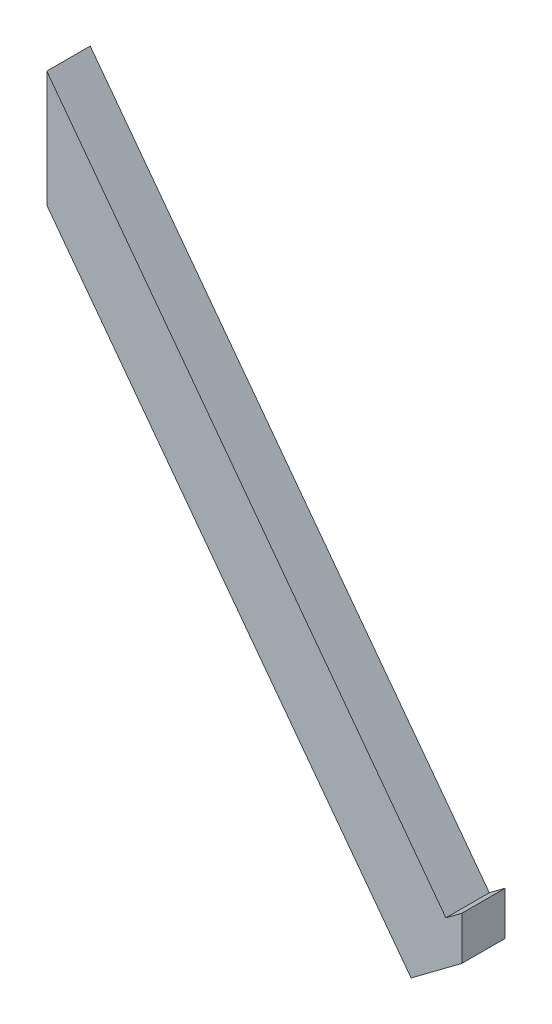
ISO-10303-21;
HEADER;
FILE_DESCRIPTION(('STEP AP214'),'2;1');
FILE_NAME('part.step','',(''),(''),'','','');
FILE_SCHEMA(('AUTOMOTIVE_DESIGN { 1 0 10303 214 1 1 1 1 }'));
ENDSEC;
DATA;
#1=APPLICATION_CONTEXT('core data for automotive mechanical design processes');
#2=APPLICATION_PROTOCOL_DEFINITION('international standard','automotive_design',2000,#1);
#3=PRODUCT_CONTEXT('',#1,'mechanical');
#4=PRODUCT('Part','Part','',(#3));
#5=PRODUCT_RELATED_PRODUCT_CATEGORY('part','',(#4));
#6=PRODUCT_DEFINITION_FORMATION('','',#4);
#7=PRODUCT_DEFINITION_CONTEXT('part definition',#1,'design');
#8=PRODUCT_DEFINITION('design','',#6,#7);
#9=PRODUCT_DEFINITION_SHAPE('','',#8);
#10=(LENGTH_UNIT() NAMED_UNIT(*) SI_UNIT(.MILLI.,.METRE.));
#11=(NAMED_UNIT(*) PLANE_ANGLE_UNIT() SI_UNIT($,.RADIAN.));
#12=(NAMED_UNIT(*) SI_UNIT($,.STERADIAN.) SOLID_ANGLE_UNIT());
#13=UNCERTAINTY_MEASURE_WITH_UNIT(LENGTH_MEASURE(1.E-05),#10,'distance_accuracy_value','');
#14=(GEOMETRIC_REPRESENTATION_CONTEXT(3) GLOBAL_UNCERTAINTY_ASSIGNED_CONTEXT((#13)) GLOBAL_UNIT_ASSIGNED_CONTEXT((#10,
#11,#12)) REPRESENTATION_CONTEXT('',''));
#15=CARTESIAN_POINT('',(0.,0.,0.));
#16=DIRECTION('',(0.,0.,1.));
#17=DIRECTION('',(1.,0.,0.));
#18=AXIS2_PLACEMENT_3D('',#15,#16,#17);
#19=CARTESIAN_POINT('',(-48.4510576676489,25.0386405763315,5.));
#20=DIRECTION('',(1.,0.,0.));
#21=DIRECTION('',(0.,0.,-1.));
#22=AXIS2_PLACEMENT_3D('',#19,#20,#21);
#23=PLANE('',#22);
#24=DIRECTION('',(0.,-1.,0.));
#25=VECTOR('',#24,1.);
#26=CARTESIAN_POINT('',(-48.4510576676489,25.0386405763315,0.));
#27=LINE('',#26,#25);
#28=CARTESIAN_POINT('',(-48.4510576676489,38.3967930670941,0.));
#29=VERTEX_POINT('',#28);
#30=CARTESIAN_POINT('',(-48.4510576676489,25.0386405763315,0.));
#31=VERTEX_POINT('',#30);
#32=EDGE_CURVE('E118',#29,#31,#27,.T.);
#33=ORIENTED_EDGE('',*,*,#32,.T.);
#34=DIRECTION('',(0.,0.,-1.));
#35=VECTOR('',#34,1.);
#36=CARTESIAN_POINT('',(-48.4510576676489,25.0386405763315,5.));
#37=LINE('',#36,#35);
#38=CARTESIAN_POINT('',(-48.4510576676489,25.0386405763315,5.));
#39=VERTEX_POINT('',#38);
#40=EDGE_CURVE('E11',#39,#31,#37,.T.);
#41=ORIENTED_EDGE('',*,*,#40,.F.);
#42=DIRECTION('',(0.,-1.,0.));
#43=VECTOR('',#42,1.);
#44=CARTESIAN_POINT('',(-48.4510576676489,25.0386405763315,5.));
#45=LINE('',#44,#43);
#46=CARTESIAN_POINT('',(-48.4510576676489,38.3967930670941,5.));
#47=VERTEX_POINT('',#46);
#48=EDGE_CURVE('E128',#47,#39,#45,.T.);
#49=ORIENTED_EDGE('',*,*,#48,.F.);
#50=DIRECTION('',(0.,0.,-1.));
#51=VECTOR('',#50,1.);
#52=CARTESIAN_POINT('',(-48.4510576676489,38.3967930670941,5.));
#53=LINE('',#52,#51);
#54=EDGE_CURVE('E114',#47,#29,#53,.T.);
#55=ORIENTED_EDGE('',*,*,#54,.T.);
#56=EDGE_LOOP('',(#33,#41,#49,#55));
#57=FACE_BOUND('',#56,.T.);
#58=ADVANCED_FACE('F34',(#57),#23,.F.);
#59=CARTESIAN_POINT('',(-6.52909275616516,-31.0198008750711,5.));
#60=DIRECTION('',(0.800834877877179,0.598885213021196,0.));
#61=DIRECTION('',(-0.598885213021196,0.80083487787718,0.));
#62=AXIS2_PLACEMENT_3D('',#59,#60,#61);
#63=PLANE('',#62);
#64=DIRECTION('',(0.598885213021196,-0.800834877877179,0.));
#65=VECTOR('',#64,1.);
#66=CARTESIAN_POINT('',(-6.52909275616516,-31.0198008750711,0.));
#67=LINE('',#66,#65);
#68=CARTESIAN_POINT('',(-6.52909275616516,-31.0198008750711,0.));
#69=VERTEX_POINT('',#68);
#70=EDGE_CURVE('E121',#31,#69,#67,.T.);
#71=ORIENTED_EDGE('',*,*,#70,.T.);
#72=DIRECTION('',(0.,0.,-1.));
#73=VECTOR('',#72,1.);
#74=CARTESIAN_POINT('',(-6.52909275616516,-31.0198008750711,5.));
#75=LINE('',#74,#73);
#76=CARTESIAN_POINT('',(-6.52909275616516,-31.0198008750711,5.));
#77=VERTEX_POINT('',#76);
#78=EDGE_CURVE('E42',#77,#69,#75,.T.);
#79=ORIENTED_EDGE('',*,*,#78,.F.);
#80=DIRECTION('',(0.598885213021196,-0.800834877877179,0.));
#81=VECTOR('',#80,1.);
#82=CARTESIAN_POINT('',(-6.52909275616516,-31.0198008750711,5.));
#83=LINE('',#82,#81);
#84=EDGE_CURVE('E87',#39,#77,#83,.T.);
#85=ORIENTED_EDGE('',*,*,#84,.F.);
#86=ORIENTED_EDGE('',*,*,#40,.T.);
#87=EDGE_LOOP('',(#71,#79,#85,#86));
#88=FACE_BOUND('',#87,.T.);
#89=ADVANCED_FACE('F152',(#88),#63,.F.);
#90=CARTESIAN_POINT('',(-0.693903445079616,-26.6560940859115,5.));
#91=DIRECTION('',(-0.598885213021196,0.80083487787718,0.));
#92=DIRECTION('',(-0.80083487787718,-0.598885213021196,0.));
#93=AXIS2_PLACEMENT_3D('',#90,#91,#92);
#94=PLANE('',#93);
#95=DIRECTION('',(0.80083487787718,0.598885213021196,0.));
#96=VECTOR('',#95,1.);
#97=CARTESIAN_POINT('',(-0.693903445079616,-26.6560940859115,0.));
#98=LINE('',#97,#96);
#99=CARTESIAN_POINT('',(-0.693903445079616,-26.6560940859115,0.));
#100=VERTEX_POINT('',#99);
#101=EDGE_CURVE('E123',#69,#100,#98,.T.);
#102=ORIENTED_EDGE('',*,*,#101,.T.);
#103=DIRECTION('',(0.,0.,-1.));
#104=VECTOR('',#103,1.);
#105=CARTESIAN_POINT('',(-0.693903445079616,-26.6560940859115,5.));
#106=LINE('',#105,#104);
#107=CARTESIAN_POINT('',(-0.693903445079616,-26.6560940859115,5.));
#108=VERTEX_POINT('',#107);
#109=EDGE_CURVE('E109',#108,#100,#106,.T.);
#110=ORIENTED_EDGE('',*,*,#109,.F.);
#111=DIRECTION('',(0.80083487787718,0.598885213021196,0.));
#112=VECTOR('',#111,1.);
#113=CARTESIAN_POINT('',(-0.693903445079616,-26.6560940859115,5.));
#114=LINE('',#113,#112);
#115=EDGE_CURVE('E100',#77,#108,#114,.T.);
#116=ORIENTED_EDGE('',*,*,#115,.F.);
#117=ORIENTED_EDGE('',*,*,#78,.T.);
#118=EDGE_LOOP('',(#102,#110,#116,#117));
#119=FACE_BOUND('',#118,.T.);
#120=ADVANCED_FACE('F134',(#119),#94,.F.);
#121=CARTESIAN_POINT('',(-0.693903445079618,-21.6496036691413,5.));
#122=DIRECTION('',(-1.,0.,0.));
#123=DIRECTION('',(0.,-1.,0.));
#124=AXIS2_PLACEMENT_3D('',#121,#122,#123);
#125=PLANE('',#124);
#126=DIRECTION('',(0.,1.,0.));
#127=VECTOR('',#126,1.);
#128=CARTESIAN_POINT('',(-0.693903445079618,-21.6496036691413,0.));
#129=LINE('',#128,#127);
#130=CARTESIAN_POINT('',(-0.693903445079618,-21.6496036691413,0.));
#131=VERTEX_POINT('',#130);
#132=EDGE_CURVE('E108',#100,#131,#129,.T.);
#133=ORIENTED_EDGE('',*,*,#132,.T.);
#134=DIRECTION('',(0.,0.,-1.));
#135=VECTOR('',#134,1.);
#136=CARTESIAN_POINT('',(-0.693903445079618,-21.6496036691413,5.));
#137=LINE('',#136,#135);
#138=CARTESIAN_POINT('',(-0.693903445079618,-21.6496036691413,5.));
#139=VERTEX_POINT('',#138);
#140=EDGE_CURVE('E105',#139,#131,#137,.T.);
#141=ORIENTED_EDGE('',*,*,#140,.F.);
#142=DIRECTION('',(0.,1.,0.));
#143=VECTOR('',#142,1.);
#144=CARTESIAN_POINT('',(-0.693903445079618,-21.6496036691413,5.));
#145=LINE('',#144,#143);
#146=EDGE_CURVE('E94',#108,#139,#145,.T.);
#147=ORIENTED_EDGE('',*,*,#146,.F.);
#148=ORIENTED_EDGE('',*,*,#109,.T.);
#149=EDGE_LOOP('',(#133,#141,#147,#148));
#150=FACE_BOUND('',#149,.T.);
#151=ADVANCED_FACE('F106',(#150),#125,.F.);
#152=CARTESIAN_POINT('',(-2.5235674221956,-23.0178741215933,5.));
#153=DIRECTION('',(0.598885213021197,-0.800834877877179,0.));
#154=DIRECTION('',(0.800834877877179,0.598885213021197,0.));
#155=AXIS2_PLACEMENT_3D('',#152,#153,#154);
#156=PLANE('',#155);
#157=DIRECTION('',(-0.800834877877179,-0.598885213021197,0.));
#158=VECTOR('',#157,1.);
#159=CARTESIAN_POINT('',(-2.5235674221956,-23.0178741215933,0.));
#160=LINE('',#159,#158);
#161=CARTESIAN_POINT('',(-2.5235674221956,-23.0178741215933,0.));
#162=VERTEX_POINT('',#161);
#163=EDGE_CURVE('E73',#131,#162,#160,.T.);
#164=ORIENTED_EDGE('',*,*,#163,.T.);
#165=DIRECTION('',(0.,0.,-1.));
#166=VECTOR('',#165,1.);
#167=CARTESIAN_POINT('',(-2.5235674221956,-23.0178741215933,5.));
#168=LINE('',#167,#166);
#169=CARTESIAN_POINT('',(-2.5235674221956,-23.0178741215933,5.));
#170=VERTEX_POINT('',#169);
#171=EDGE_CURVE('E110',#170,#162,#168,.T.);
#172=ORIENTED_EDGE('',*,*,#171,.F.);
#173=DIRECTION('',(-0.800834877877179,-0.598885213021197,0.));
#174=VECTOR('',#173,1.);
#175=CARTESIAN_POINT('',(-2.5235674221956,-23.0178741215933,5.));
#176=LINE('',#175,#174);
#177=EDGE_CURVE('E98',#139,#170,#176,.T.);
#178=ORIENTED_EDGE('',*,*,#177,.F.);
#179=ORIENTED_EDGE('',*,*,#140,.T.);
#180=EDGE_LOOP('',(#164,#172,#178,#179));
#181=FACE_BOUND('',#180,.T.);
#182=ADVANCED_FACE('F112',(#181),#156,.F.);
#183=CARTESIAN_POINT('',(-48.4510576676489,38.3967930670941,5.));
#184=DIRECTION('',(-0.800834877877179,-0.598885213021196,0.));
#185=DIRECTION('',(0.598885213021196,-0.800834877877179,0.));
#186=AXIS2_PLACEMENT_3D('',#183,#184,#185);
#187=PLANE('',#186);
#188=DIRECTION('',(-0.598885213021196,0.800834877877179,0.));
#189=VECTOR('',#188,1.);
#190=CARTESIAN_POINT('',(-48.4510576676489,38.3967930670941,0.));
#191=LINE('',#190,#189);
#192=EDGE_CURVE('E79',#162,#29,#191,.T.);
#193=ORIENTED_EDGE('',*,*,#192,.T.);
#194=ORIENTED_EDGE('',*,*,#54,.F.);
#195=DIRECTION('',(-0.598885213021196,0.800834877877179,0.));
#196=VECTOR('',#195,1.);
#197=CARTESIAN_POINT('',(-48.4510576676489,38.3967930670941,5.));
#198=LINE('',#197,#196);
#199=EDGE_CURVE('E50',#170,#47,#198,.T.);
#200=ORIENTED_EDGE('',*,*,#199,.F.);
#201=ORIENTED_EDGE('',*,*,#171,.T.);
#202=EDGE_LOOP('',(#193,#194,#200,#201));
#203=FACE_BOUND('',#202,.T.);
#204=ADVANCED_FACE('F141',(#203),#187,.F.);
#205=CARTESIAN_POINT('',(0.,0.,5.));
#206=DIRECTION('',(0.,0.,-1.));
#207=DIRECTION('',(-1.,0.,0.));
#208=AXIS2_PLACEMENT_3D('',#205,#206,#207);
#209=PLANE('',#208);
#210=ORIENTED_EDGE('',*,*,#48,.T.);
#211=ORIENTED_EDGE('',*,*,#84,.T.);
#212=ORIENTED_EDGE('',*,*,#115,.T.);
#213=ORIENTED_EDGE('',*,*,#146,.T.);
#214=ORIENTED_EDGE('',*,*,#177,.T.);
#215=ORIENTED_EDGE('',*,*,#199,.T.);
#216=EDGE_LOOP('',(#210,#211,#212,#213,#214,#215));
#217=FACE_BOUND('',#216,.T.);
#218=ADVANCED_FACE('F96',(#217),#209,.F.);
#219=CARTESIAN_POINT('',(0.,0.,0.));
#220=DIRECTION('',(0.,0.,-1.));
#221=DIRECTION('',(-1.,0.,0.));
#222=AXIS2_PLACEMENT_3D('',#219,#220,#221);
#223=PLANE('',#222);
#224=ORIENTED_EDGE('',*,*,#32,.F.);
#225=ORIENTED_EDGE('',*,*,#192,.F.);
#226=ORIENTED_EDGE('',*,*,#163,.F.);
#227=ORIENTED_EDGE('',*,*,#132,.F.);
#228=ORIENTED_EDGE('',*,*,#101,.F.);
#229=ORIENTED_EDGE('',*,*,#70,.F.);
#230=EDGE_LOOP('',(#224,#225,#226,#227,#228,#229));
#231=FACE_BOUND('',#230,.T.);
#232=ADVANCED_FACE('F137',(#231),#223,.T.);
#233=CLOSED_SHELL('',(#58,#89,#120,#151,#182,#204,#218,#232));
#234=MANIFOLD_SOLID_BREP('B2',#233);
#235=ADVANCED_BREP_SHAPE_REPRESENTATION('',(#18,#234),#14);
#236=SHAPE_DEFINITION_REPRESENTATION(#9,#235);
ENDSEC;
END-ISO-10303-21;
